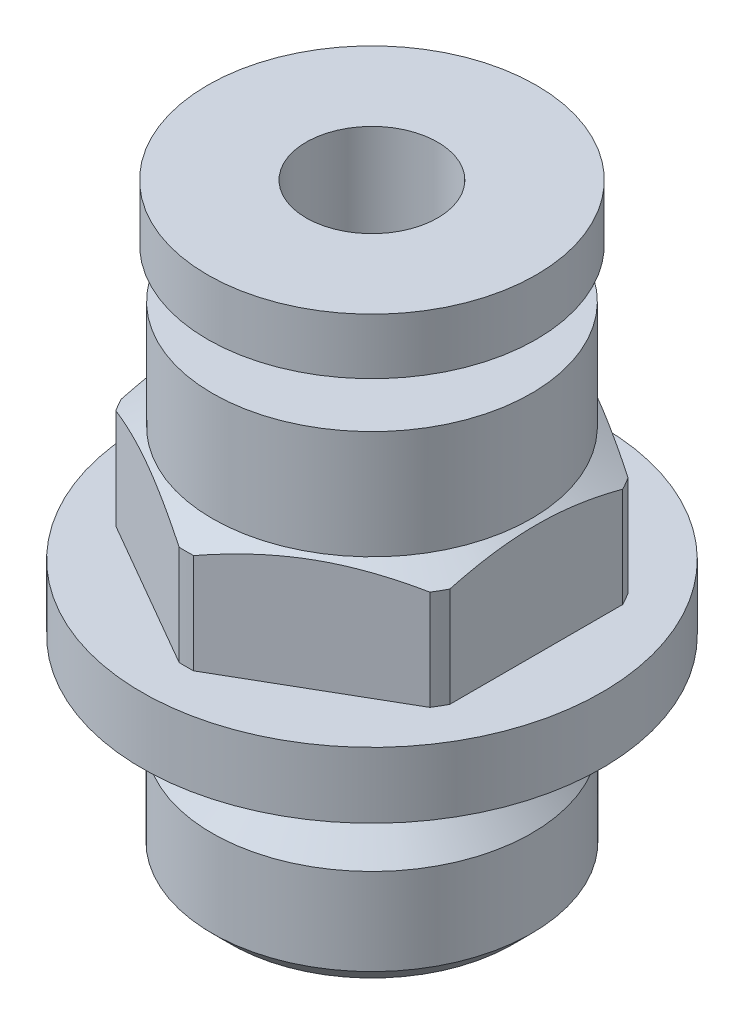
ISO-10303-21;
HEADER;
FILE_DESCRIPTION(('STEP AP214'),'2;1');
FILE_NAME('part.step','',(''),(''),'','','');
FILE_SCHEMA(('AUTOMOTIVE_DESIGN { 1 0 10303 214 1 1 1 1 }'));
ENDSEC;
DATA;
#1=APPLICATION_CONTEXT('core data for automotive mechanical design processes');
#2=APPLICATION_PROTOCOL_DEFINITION('international standard','automotive_design',2000,#1);
#3=PRODUCT_CONTEXT('',#1,'mechanical');
#4=PRODUCT('Part','Part','',(#3));
#5=PRODUCT_RELATED_PRODUCT_CATEGORY('part','',(#4));
#6=PRODUCT_DEFINITION_FORMATION('','',#4);
#7=PRODUCT_DEFINITION_CONTEXT('part definition',#1,'design');
#8=PRODUCT_DEFINITION('design','',#6,#7);
#9=PRODUCT_DEFINITION_SHAPE('','',#8);
#10=(LENGTH_UNIT() NAMED_UNIT(*) SI_UNIT(.MILLI.,.METRE.));
#11=(NAMED_UNIT(*) PLANE_ANGLE_UNIT() SI_UNIT($,.RADIAN.));
#12=(NAMED_UNIT(*) SI_UNIT($,.STERADIAN.) SOLID_ANGLE_UNIT());
#13=UNCERTAINTY_MEASURE_WITH_UNIT(LENGTH_MEASURE(1.E-05),#10,'distance_accuracy_value','');
#14=(GEOMETRIC_REPRESENTATION_CONTEXT(3) GLOBAL_UNCERTAINTY_ASSIGNED_CONTEXT((#13)) GLOBAL_UNIT_ASSIGNED_CONTEXT((#10,
#11,#12)) REPRESENTATION_CONTEXT('',''));
#15=CARTESIAN_POINT('',(0.,0.,0.));
#16=DIRECTION('',(0.,0.,1.));
#17=DIRECTION('',(1.,0.,0.));
#18=AXIS2_PLACEMENT_3D('',#15,#16,#17);
#19=CARTESIAN_POINT('',(0.,14.8,0.));
#20=DIRECTION('',(0.,1.,0.));
#21=DIRECTION('',(0.,0.,1.));
#22=AXIS2_PLACEMENT_3D('',#19,#20,#21);
#23=PLANE('',#22);
#24=CARTESIAN_POINT('',(0.,14.8,0.));
#25=DIRECTION('',(0.,1.,0.));
#26=DIRECTION('',(0.,0.,1.));
#27=AXIS2_PLACEMENT_3D('',#24,#25,#26);
#28=CIRCLE('',#27,4.85);
#29=CARTESIAN_POINT('',(0.,14.8,4.85));
#30=VERTEX_POINT('',#29);
#31=EDGE_CURVE('E425',#30,#30,#28,.T.);
#32=ORIENTED_EDGE('',*,*,#31,.T.);
#33=EDGE_LOOP('',(#32));
#34=FACE_BOUND('',#33,.T.);
#35=CARTESIAN_POINT('',(0.,14.8,0.));
#36=DIRECTION('',(0.,1.,0.));
#37=DIRECTION('',(0.,0.,1.));
#38=AXIS2_PLACEMENT_3D('',#35,#36,#37);
#39=CIRCLE('',#38,2.55);
#40=CARTESIAN_POINT('',(0.,14.8,2.55));
#41=VERTEX_POINT('',#40);
#42=EDGE_CURVE('E741',#41,#41,#39,.T.);
#43=ORIENTED_EDGE('',*,*,#42,.F.);
#44=EDGE_LOOP('',(#43));
#45=FACE_BOUND('',#44,.T.);
#46=ADVANCED_FACE('F63',(#34,#45),#23,.T.);
#47=CARTESIAN_POINT('',(0.,3.983,0.));
#48=DIRECTION('',(0.,-1.,0.));
#49=DIRECTION('',(0.,0.,-1.));
#50=AXIS2_PLACEMENT_3D('',#47,#48,#49);
#51=CONICAL_SURFACE('',#50,4.1,0.785398163397448);
#52=CARTESIAN_POINT('',(0.,3.219,0.));
#53=DIRECTION('',(0.,-1.,0.));
#54=DIRECTION('',(0.,0.,-1.));
#55=AXIS2_PLACEMENT_3D('',#52,#53,#54);
#56=CIRCLE('',#55,4.864);
#57=CARTESIAN_POINT('',(0.,3.219,-4.864));
#58=VERTEX_POINT('',#57);
#59=EDGE_CURVE('E381',#58,#58,#56,.T.);
#60=ORIENTED_EDGE('',*,*,#59,.F.);
#61=EDGE_LOOP('',(#60));
#62=FACE_BOUND('',#61,.T.);
#63=CARTESIAN_POINT('',(0.,3.983,0.));
#64=DIRECTION('',(0.,-1.,0.));
#65=DIRECTION('',(0.,0.,-1.));
#66=AXIS2_PLACEMENT_3D('',#63,#64,#65);
#67=CIRCLE('',#66,4.1);
#68=CARTESIAN_POINT('',(0.,3.983,-4.1));
#69=VERTEX_POINT('',#68);
#70=EDGE_CURVE('E373',#69,#69,#67,.F.);
#71=ORIENTED_EDGE('',*,*,#70,.F.);
#72=EDGE_LOOP('',(#71));
#73=FACE_BOUND('',#72,.T.);
#74=ADVANCED_FACE('F691',(#62,#73),#51,.T.);
#75=CARTESIAN_POINT('',(0.,3.983,0.));
#76=DIRECTION('',(0.,-1.,0.));
#77=DIRECTION('',(0.,0.,-1.));
#78=AXIS2_PLACEMENT_3D('',#75,#76,#77);
#79=CYLINDRICAL_SURFACE('',#78,4.1);
#80=ORIENTED_EDGE('',*,*,#70,.T.);
#81=EDGE_LOOP('',(#80));
#82=FACE_BOUND('',#81,.T.);
#83=CARTESIAN_POINT('',(0.,6.,0.));
#84=DIRECTION('',(0.,-1.,0.));
#85=DIRECTION('',(0.,0.,-1.));
#86=AXIS2_PLACEMENT_3D('',#83,#84,#85);
#87=CIRCLE('',#86,4.1);
#88=CARTESIAN_POINT('',(0.,6.,-4.1));
#89=VERTEX_POINT('',#88);
#90=EDGE_CURVE('E362',#89,#89,#87,.F.);
#91=ORIENTED_EDGE('',*,*,#90,.F.);
#92=EDGE_LOOP('',(#91));
#93=FACE_BOUND('',#92,.T.);
#94=ADVANCED_FACE('F697',(#82,#93),#79,.T.);
#95=CARTESIAN_POINT('',(0.,6.,0.));
#96=DIRECTION('',(0.,-1.,0.));
#97=DIRECTION('',(0.,0.,-1.));
#98=AXIS2_PLACEMENT_3D('',#95,#96,#97);
#99=TOROIDAL_SURFACE('',#98,4.99,0.89);
#100=ORIENTED_EDGE('',*,*,#90,.T.);
#101=EDGE_LOOP('',(#100));
#102=FACE_BOUND('',#101,.T.);
#103=CARTESIAN_POINT('',(0.,6.,0.));
#104=DIRECTION('',(0.,-1.,0.));
#105=DIRECTION('',(0.,0.,-1.));
#106=AXIS2_PLACEMENT_3D('',#103,#104,#105);
#107=CIRCLE('',#106,5.88);
#108=CARTESIAN_POINT('',(0.,6.,-5.88));
#109=VERTEX_POINT('',#108);
#110=EDGE_CURVE('E358',#109,#109,#107,.F.);
#111=ORIENTED_EDGE('',*,*,#110,.F.);
#112=EDGE_LOOP('',(#111));
#113=FACE_BOUND('',#112,.T.);
#114=ADVANCED_FACE('F920',(#102,#113),#99,.T.);
#115=CARTESIAN_POINT('',(-7.08400000000001,6.,7.084));
#116=DIRECTION('',(0.,-1.,0.));
#117=DIRECTION('',(0.,0.,-1.));
#118=AXIS2_PLACEMENT_3D('',#115,#116,#117);
#119=PLANE('',#118);
#120=ORIENTED_EDGE('',*,*,#110,.T.);
#121=EDGE_LOOP('',(#120));
#122=FACE_BOUND('',#121,.T.);
#123=CARTESIAN_POINT('',(0.,6.,0.));
#124=DIRECTION('',(0.,-1.,0.));
#125=DIRECTION('',(0.,0.,-1.));
#126=AXIS2_PLACEMENT_3D('',#123,#124,#125);
#127=CIRCLE('',#126,7.);
#128=CARTESIAN_POINT('',(0.,6.,-7.));
#129=VERTEX_POINT('',#128);
#130=EDGE_CURVE('E233',#129,#129,#127,.F.);
#131=ORIENTED_EDGE('',*,*,#130,.F.);
#132=EDGE_LOOP('',(#131));
#133=FACE_BOUND('',#132,.T.);
#134=ADVANCED_FACE('F911',(#122,#133),#119,.T.);
#135=CARTESIAN_POINT('',(0.,8.,0.));
#136=DIRECTION('',(0.,-1.,0.));
#137=DIRECTION('',(0.,0.,-1.));
#138=AXIS2_PLACEMENT_3D('',#135,#136,#137);
#139=CYLINDRICAL_SURFACE('',#138,5.65);
#140=DIRECTION('',(0.,1.,0.));
#141=VECTOR('',#140,1.);
#142=CARTESIAN_POINT('',(4.7785686296445,8.,3.01459480722991));
#143=LINE('',#142,#141);
#144=CARTESIAN_POINT('',(4.77856862964448,8.,3.01459480722992));
#145=VERTEX_POINT('',#144);
#146=CARTESIAN_POINT('',(4.77856862964449,11.0381197846483,3.01459480722992));
#147=VERTEX_POINT('',#146);
#148=EDGE_CURVE('E440',#145,#147,#143,.T.);
#149=ORIENTED_EDGE('',*,*,#148,.F.);
#150=CARTESIAN_POINT('',(0.,8.,0.));
#151=DIRECTION('',(0.,-1.,0.));
#152=DIRECTION('',(0.,0.,-1.));
#153=AXIS2_PLACEMENT_3D('',#150,#151,#152);
#154=CIRCLE('',#153,5.65);
#155=CARTESIAN_POINT('',(4.99999999999998,8.,2.63106442338458));
#156=VERTEX_POINT('',#155);
#157=EDGE_CURVE('E369',#145,#156,#154,.F.);
#158=ORIENTED_EDGE('',*,*,#157,.T.);
#159=DIRECTION('',(0.,1.,0.));
#160=VECTOR('',#159,1.);
#161=CARTESIAN_POINT('',(5.,8.,2.63106442338457));
#162=LINE('',#161,#160);
#163=CARTESIAN_POINT('',(5.,11.0381197846483,2.63106442338457));
#164=VERTEX_POINT('',#163);
#165=EDGE_CURVE('E615',#164,#156,#162,.F.);
#166=ORIENTED_EDGE('',*,*,#165,.F.);
#167=CARTESIAN_POINT('',(0.,11.0381197846483,0.));
#168=DIRECTION('',(0.,-1.,0.));
#169=DIRECTION('',(0.,0.,-1.));
#170=AXIS2_PLACEMENT_3D('',#167,#168,#169);
#171=CIRCLE('',#170,5.65);
#172=EDGE_CURVE('E361',#164,#147,#171,.T.);
#173=ORIENTED_EDGE('',*,*,#172,.T.);
#174=EDGE_LOOP('',(#149,#158,#166,#173));
#175=FACE_BOUND('',#174,.T.);
#176=ADVANCED_FACE('F902',(#175),#139,.T.);
#177=CARTESIAN_POINT('',(0.,8.,0.));
#178=DIRECTION('',(0.,-1.,0.));
#179=DIRECTION('',(0.,0.,-1.));
#180=AXIS2_PLACEMENT_3D('',#177,#178,#179);
#181=CYLINDRICAL_SURFACE('',#180,5.65);
#182=DIRECTION('',(0.,1.,0.));
#183=VECTOR('',#182,1.);
#184=CARTESIAN_POINT('',(-0.2214313703555,8.,5.64565923061448));
#185=LINE('',#184,#183);
#186=CARTESIAN_POINT('',(-0.221431370355493,8.,5.6456592306145));
#187=VERTEX_POINT('',#186);
#188=CARTESIAN_POINT('',(-0.2214313703555,11.0381197846483,5.64565923061448));
#189=VERTEX_POINT('',#188);
#190=EDGE_CURVE('E591',#187,#189,#185,.T.);
#191=ORIENTED_EDGE('',*,*,#190,.F.);
#192=CARTESIAN_POINT('',(0.,8.,0.));
#193=DIRECTION('',(0.,-1.,0.));
#194=DIRECTION('',(0.,0.,-1.));
#195=AXIS2_PLACEMENT_3D('',#192,#193,#194);
#196=CIRCLE('',#195,5.65);
#197=CARTESIAN_POINT('',(0.221431370355489,8.,5.6456592306145));
#198=VERTEX_POINT('',#197);
#199=EDGE_CURVE('E196',#187,#198,#196,.F.);
#200=ORIENTED_EDGE('',*,*,#199,.T.);
#201=DIRECTION('',(0.,1.,0.));
#202=VECTOR('',#201,1.);
#203=CARTESIAN_POINT('',(0.2214313703555,8.,5.64565923061448));
#204=LINE('',#203,#202);
#205=CARTESIAN_POINT('',(0.2214313703555,11.0381197846483,5.64565923061448));
#206=VERTEX_POINT('',#205);
#207=EDGE_CURVE('E492',#206,#198,#204,.F.);
#208=ORIENTED_EDGE('',*,*,#207,.F.);
#209=CARTESIAN_POINT('',(0.,11.0381197846483,0.));
#210=DIRECTION('',(0.,-1.,0.));
#211=DIRECTION('',(0.,0.,-1.));
#212=AXIS2_PLACEMENT_3D('',#209,#210,#211);
#213=CIRCLE('',#212,5.65);
#214=EDGE_CURVE('E550',#206,#189,#213,.T.);
#215=ORIENTED_EDGE('',*,*,#214,.T.);
#216=EDGE_LOOP('',(#191,#200,#208,#215));
#217=FACE_BOUND('',#216,.T.);
#218=ADVANCED_FACE('F894',(#217),#181,.T.);
#219=CARTESIAN_POINT('',(0.,8.,0.));
#220=DIRECTION('',(0.,-1.,0.));
#221=DIRECTION('',(0.,0.,-1.));
#222=AXIS2_PLACEMENT_3D('',#219,#220,#221);
#223=CYLINDRICAL_SURFACE('',#222,5.65);
#224=DIRECTION('',(0.,1.,0.));
#225=VECTOR('',#224,1.);
#226=CARTESIAN_POINT('',(-5.,8.,2.63106442338458));
#227=LINE('',#226,#225);
#228=CARTESIAN_POINT('',(-4.99999999999998,8.,2.63106442338459));
#229=VERTEX_POINT('',#228);
#230=CARTESIAN_POINT('',(-5.,11.0381197846483,2.63106442338458));
#231=VERTEX_POINT('',#230);
#232=EDGE_CURVE('E186',#229,#231,#227,.T.);
#233=ORIENTED_EDGE('',*,*,#232,.F.);
#234=CARTESIAN_POINT('',(0.,8.,0.));
#235=DIRECTION('',(0.,-1.,0.));
#236=DIRECTION('',(0.,0.,-1.));
#237=AXIS2_PLACEMENT_3D('',#234,#235,#236);
#238=CIRCLE('',#237,5.65);
#239=CARTESIAN_POINT('',(-4.77856862964448,8.,3.01459480722992));
#240=VERTEX_POINT('',#239);
#241=EDGE_CURVE('E195',#229,#240,#238,.F.);
#242=ORIENTED_EDGE('',*,*,#241,.T.);
#243=DIRECTION('',(0.,1.,0.));
#244=VECTOR('',#243,1.);
#245=CARTESIAN_POINT('',(-4.7785686296445,8.,3.01459480722991));
#246=LINE('',#245,#244);
#247=CARTESIAN_POINT('',(-4.7785686296445,11.0381197846483,3.01459480722991));
#248=VERTEX_POINT('',#247);
#249=EDGE_CURVE('E189',#248,#240,#246,.F.);
#250=ORIENTED_EDGE('',*,*,#249,.F.);
#251=CARTESIAN_POINT('',(0.,11.0381197846483,0.));
#252=DIRECTION('',(0.,-1.,0.));
#253=DIRECTION('',(0.,0.,-1.));
#254=AXIS2_PLACEMENT_3D('',#251,#252,#253);
#255=CIRCLE('',#254,5.65);
#256=EDGE_CURVE('E183',#248,#231,#255,.T.);
#257=ORIENTED_EDGE('',*,*,#256,.T.);
#258=EDGE_LOOP('',(#233,#242,#250,#257));
#259=FACE_BOUND('',#258,.T.);
#260=ADVANCED_FACE('F185',(#259),#223,.T.);
#261=CARTESIAN_POINT('',(0.,8.,0.));
#262=DIRECTION('',(0.,-1.,0.));
#263=DIRECTION('',(0.,0.,-1.));
#264=AXIS2_PLACEMENT_3D('',#261,#262,#263);
#265=CYLINDRICAL_SURFACE('',#264,5.65);
#266=DIRECTION('',(0.,1.,0.));
#267=VECTOR('',#266,1.);
#268=CARTESIAN_POINT('',(5.,8.,-2.63106442338468));
#269=LINE('',#268,#267);
#270=CARTESIAN_POINT('',(4.99999999999999,8.,-2.63106442338462));
#271=VERTEX_POINT('',#270);
#272=CARTESIAN_POINT('',(5.,11.0381197846483,-2.63106442338463));
#273=VERTEX_POINT('',#272);
#274=EDGE_CURVE('E490',#271,#273,#269,.T.);
#275=ORIENTED_EDGE('',*,*,#274,.F.);
#276=CARTESIAN_POINT('',(0.,8.,0.));
#277=DIRECTION('',(0.,-1.,0.));
#278=DIRECTION('',(0.,0.,-1.));
#279=AXIS2_PLACEMENT_3D('',#276,#277,#278);
#280=CIRCLE('',#279,5.65);
#281=CARTESIAN_POINT('',(4.77856862964449,8.,-3.01459480722991));
#282=VERTEX_POINT('',#281);
#283=EDGE_CURVE('E477',#271,#282,#280,.F.);
#284=ORIENTED_EDGE('',*,*,#283,.T.);
#285=DIRECTION('',(0.,1.,0.));
#286=VECTOR('',#285,1.);
#287=CARTESIAN_POINT('',(4.7785686296445,8.,-3.01459480722991));
#288=LINE('',#287,#286);
#289=CARTESIAN_POINT('',(4.7785686296445,11.0381197846483,-3.01459480722991));
#290=VERTEX_POINT('',#289);
#291=EDGE_CURVE('E205',#290,#282,#288,.F.);
#292=ORIENTED_EDGE('',*,*,#291,.F.);
#293=CARTESIAN_POINT('',(0.,11.0381197846483,0.));
#294=DIRECTION('',(0.,-1.,0.));
#295=DIRECTION('',(0.,0.,-1.));
#296=AXIS2_PLACEMENT_3D('',#293,#294,#295);
#297=CIRCLE('',#296,5.65);
#298=EDGE_CURVE('E472',#290,#273,#297,.T.);
#299=ORIENTED_EDGE('',*,*,#298,.T.);
#300=EDGE_LOOP('',(#275,#284,#292,#299));
#301=FACE_BOUND('',#300,.T.);
#302=ADVANCED_FACE('F680',(#301),#265,.T.);
#303=CARTESIAN_POINT('',(0.,6.,0.));
#304=DIRECTION('',(0.,-1.,0.));
#305=DIRECTION('',(0.,0.,-1.));
#306=AXIS2_PLACEMENT_3D('',#303,#304,#305);
#307=CYLINDRICAL_SURFACE('',#306,7.);
#308=ORIENTED_EDGE('',*,*,#130,.T.);
#309=EDGE_LOOP('',(#308));
#310=FACE_BOUND('',#309,.T.);
#311=CARTESIAN_POINT('',(0.,8.,0.));
#312=DIRECTION('',(0.,-1.,0.));
#313=DIRECTION('',(0.,0.,-1.));
#314=AXIS2_PLACEMENT_3D('',#311,#312,#313);
#315=CIRCLE('',#314,7.);
#316=CARTESIAN_POINT('',(0.,8.,-7.));
#317=VERTEX_POINT('',#316);
#318=EDGE_CURVE('E299',#317,#317,#315,.F.);
#319=ORIENTED_EDGE('',*,*,#318,.F.);
#320=EDGE_LOOP('',(#319));
#321=FACE_BOUND('',#320,.T.);
#322=ADVANCED_FACE('F678',(#310,#321),#307,.T.);
#323=CARTESIAN_POINT('',(5.,8.,2.63106442338457));
#324=DIRECTION('',(1.,0.,0.));
#325=DIRECTION('',(0.,0.,-1.));
#326=AXIS2_PLACEMENT_3D('',#323,#324,#325);
#327=PLANE('',#326);
#328=ORIENTED_EDGE('',*,*,#165,.T.);
#329=DIRECTION('',(0.,0.,1.));
#330=VECTOR('',#329,1.);
#331=CARTESIAN_POINT('',(4.99999999999995,8.,0.));
#332=LINE('',#331,#330);
#333=EDGE_CURVE('E565',#271,#156,#332,.T.);
#334=ORIENTED_EDGE('',*,*,#333,.F.);
#335=ORIENTED_EDGE('',*,*,#274,.T.);
#336=CARTESIAN_POINT('',(5.,11.0381197846483,2.63106442338459));
#337=CARTESIAN_POINT('',(5.,11.0716791860062,2.50623051639842));
#338=CARTESIAN_POINT('',(5.,11.1034995369539,2.38092848319098));
#339=CARTESIAN_POINT('',(5.,11.1632197411101,2.1293534946512));
#340=CARTESIAN_POINT('',(5.,11.1911183339445,2.00308024087693));
#341=CARTESIAN_POINT('',(5.,11.2683176792158,1.62247253746527));
#342=CARTESIAN_POINT('',(5.,11.3110132599278,1.366743952635));
#343=CARTESIAN_POINT('',(5.,11.3745835287302,0.858362458645548));
#344=CARTESIAN_POINT('',(5.,11.3959288809974,0.605770365116666));
#345=CARTESIAN_POINT('',(5.,11.4113633479822,0.226377542800942));
#346=CARTESIAN_POINT('',(5.,11.4137464704296,0.09987703038702));
#347=CARTESIAN_POINT('',(5.,11.4129666646811,-0.153103973622258));
#348=CARTESIAN_POINT('',(5.,11.4098040049261,-0.279584465890311));
#349=CARTESIAN_POINT('',(5.,11.3951850252362,-0.592406635178596));
#350=CARTESIAN_POINT('',(5.,11.3804991500097,-0.778603620671558));
#351=CARTESIAN_POINT('',(5.,11.3399204387064,-1.1498404996673));
#352=CARTESIAN_POINT('',(5.,11.3140220333512,-1.3348797717377));
#353=CARTESIAN_POINT('',(5.,11.251669364345,-1.70640713055064));
#354=CARTESIAN_POINT('',(5.,11.2150416208698,-1.89286560773726));
#355=CARTESIAN_POINT('',(5.,11.1328916246093,-2.26359687926452));
#356=CARTESIAN_POINT('',(5.,11.0873797434209,-2.44787195901238));
#357=CARTESIAN_POINT('',(5.,11.0381197846483,-2.63106442338462));
#358=B_SPLINE_CURVE_WITH_KNOTS('',3,(#336,#337,#338,#339,#340,#341,#342,#343,#344,#345,#346,
#347,#348,#349,#350,#351,#352,#353,#354,#355,#356,#357),.UNSPECIFIED.,.F.,.F.,(4,2,2,2,2,2,2,2,
2,2,4),(0.,0.387779560085222,0.775683461183912,1.55271447725653,2.31221118548422,
2.69167299650802,3.07111644037376,3.63105689212536,4.19127578668472,4.76110615321377,
5.33027521953319),.UNSPECIFIED.);
#359=EDGE_CURVE('E272',#164,#273,#358,.T.);
#360=ORIENTED_EDGE('',*,*,#359,.F.);
#361=EDGE_LOOP('',(#328,#334,#335,#360));
#362=FACE_BOUND('',#361,.T.);
#363=ADVANCED_FACE('F261',(#362),#327,.T.);
#364=CARTESIAN_POINT('',(0.2214313703555,8.,5.64565923061448));
#365=DIRECTION('',(0.499999999999999,0.,0.866025403784439));
#366=DIRECTION('',(0.866025403784439,0.,-0.499999999999999));
#367=AXIS2_PLACEMENT_3D('',#364,#365,#366);
#368=PLANE('',#367);
#369=ORIENTED_EDGE('',*,*,#207,.T.);
#370=CARTESIAN_POINT('',(4.77856862964446,8.,3.01459480722992));
#371=CARTESIAN_POINT('',(4.58868791050742,8.,3.12422249153761));
#372=CARTESIAN_POINT('',(4.39880719137038,8.,3.23385017584531));
#373=CARTESIAN_POINT('',(4.0190457530963,8.,3.45310554446069));
#374=CARTESIAN_POINT('',(3.82916503395926,8.,3.56273322876838));
#375=CARTESIAN_POINT('',(3.44940359568518,8.,3.78198859738376));
#376=CARTESIAN_POINT('',(3.25952287654814,8.,3.89161628169146));
#377=CARTESIAN_POINT('',(2.87976143827405,8.,4.11087165030684));
#378=CARTESIAN_POINT('',(2.68988071913701,8.,4.22049933461453));
#379=CARTESIAN_POINT('',(2.31011928086293,8.,4.43975470322992));
#380=CARTESIAN_POINT('',(2.12023856172589,8.,4.54938238753761));
#381=CARTESIAN_POINT('',(1.74047712345181,8.,4.76863775615299));
#382=CARTESIAN_POINT('',(1.55059640431477,8.,4.87826544046069));
#383=CARTESIAN_POINT('',(1.17083496604069,8.,5.09752080907607));
#384=CARTESIAN_POINT('',(0.980954246903649,8.,5.20714849338376));
#385=CARTESIAN_POINT('',(0.601192808629568,8.,5.42640386199915));
#386=CARTESIAN_POINT('',(0.411312089492528,8.,5.53603154630684));
#387=CARTESIAN_POINT('',(0.221431370355488,8.,5.64565923061453));
#388=B_SPLINE_CURVE_WITH_KNOTS('',3,(#370,#371,#372,#373,#374,#375,#376,#377,#378,#379,#380,
#381,#382,#383,#384,#385,#386,#387),.UNSPECIFIED.,.F.,.F.,(4,2,2,2,2,2,2,2,4),(0.,
0.657766105846144,1.31553221169228,1.97329831753843,2.63106442338457,3.28883052923072,
3.94659663507686,4.604362740923,5.26212884676915),.UNSPECIFIED.);
#389=EDGE_CURVE('E1189',#145,#198,#388,.T.);
#390=ORIENTED_EDGE('',*,*,#389,.F.);
#391=ORIENTED_EDGE('',*,*,#148,.T.);
#392=CARTESIAN_POINT('',(0.221431370355484,11.0381197846483,5.64565923061449));
#393=CARTESIAN_POINT('',(0.329540705059166,11.0716791860062,5.58324227712141));
#394=CARTESIAN_POINT('',(0.438055448962651,11.1034995369539,5.52059126051769));
#395=CARTESIAN_POINT('',(0.655925779994884,11.1632197411101,5.39480376624779));
#396=CARTESIAN_POINT('',(0.765281625581917,11.1911183339445,5.33166713936066));
#397=CARTESIAN_POINT('',(1.09489756561247,11.2683176792158,5.14136328765483));
#398=CARTESIAN_POINT('',(1.31636501654933,11.3110132599278,5.01349899523969));
#399=CARTESIAN_POINT('',(1.75663630515808,11.3745835287302,4.75930824824497));
#400=CARTESIAN_POINT('',(1.97538747494919,11.3959288809974,4.63301220148053));
#401=CARTESIAN_POINT('',(2.30395129708808,11.4113633479822,4.44331579032267));
#402=CARTESIAN_POINT('',(2.41350395443029,11.4137464704296,4.38006553411571));
#403=CARTESIAN_POINT('',(2.63259193057721,11.4129666646811,4.25357503211107));
#404=CARTESIAN_POINT('',(2.74212724996451,11.4098040049261,4.19033478597704));
#405=CARTESIAN_POINT('',(3.01303919543512,11.3951850252362,4.0339237013329));
#406=CARTESIAN_POINT('',(3.1742905149801,11.3804991500097,3.94082520858642));
#407=CARTESIAN_POINT('',(3.49579108301206,11.3399204387064,3.75520676908856));
#408=CARTESIAN_POINT('',(3.65603979332281,11.3140220333512,3.66268713305336));
#409=CARTESIAN_POINT('',(3.97779192425575,11.251669364345,3.47692345364689));
#410=CARTESIAN_POINT('',(4.13926970225031,11.2150416208699,3.38369421505358));
#411=CARTESIAN_POINT('',(4.46033240137023,11.1328916246093,3.19832857928995));
#412=CARTESIAN_POINT('',(4.61991930171627,11.0873797434209,3.10619103941603));
#413=CARTESIAN_POINT('',(4.77856862964451,11.0381197846483,3.01459480722991));
#414=B_SPLINE_CURVE_WITH_KNOTS('',3,(#392,#393,#394,#395,#396,#397,#398,#399,#400,#401,#402,
#403,#404,#405,#406,#407,#408,#409,#410,#411,#412,#413),.UNSPECIFIED.,.F.,.F.,(4,2,2,2,2,2,2,2,
2,2,4),(0.,0.387779560085221,0.775683461183911,1.55271447725653,2.31221118548422,
2.69167299650802,3.07111644037376,3.63105689212535,4.1912757866847,4.76110615321374,
5.33027521953315),.UNSPECIFIED.);
#415=EDGE_CURVE('E217',#206,#147,#414,.T.);
#416=ORIENTED_EDGE('',*,*,#415,.F.);
#417=EDGE_LOOP('',(#369,#390,#391,#416));
#418=FACE_BOUND('',#417,.T.);
#419=ADVANCED_FACE('F255',(#418),#368,.T.);
#420=CARTESIAN_POINT('',(-4.7785686296445,8.,3.01459480722991));
#421=DIRECTION('',(-0.499999999999999,0.,0.866025403784439));
#422=DIRECTION('',(0.866025403784439,0.,0.499999999999999));
#423=AXIS2_PLACEMENT_3D('',#420,#421,#422);
#424=PLANE('',#423);
#425=ORIENTED_EDGE('',*,*,#249,.T.);
#426=CARTESIAN_POINT('',(-0.221431370355486,8.,5.64565923061453));
#427=CARTESIAN_POINT('',(-0.411312089492527,8.,5.53603154630684));
#428=CARTESIAN_POINT('',(-0.601192808629567,8.,5.42640386199915));
#429=CARTESIAN_POINT('',(-0.980954246903648,8.,5.20714849338376));
#430=CARTESIAN_POINT('',(-1.17083496604069,8.,5.09752080907607));
#431=CARTESIAN_POINT('',(-1.55059640431477,8.,4.87826544046069));
#432=CARTESIAN_POINT('',(-1.74047712345181,8.,4.76863775615299));
#433=CARTESIAN_POINT('',(-2.12023856172589,8.,4.54938238753761));
#434=CARTESIAN_POINT('',(-2.31011928086293,8.,4.43975470322992));
#435=CARTESIAN_POINT('',(-2.68988071913701,8.,4.22049933461453));
#436=CARTESIAN_POINT('',(-2.87976143827405,8.,4.11087165030684));
#437=CARTESIAN_POINT('',(-3.25952287654813,8.,3.89161628169146));
#438=CARTESIAN_POINT('',(-3.44940359568518,8.,3.78198859738376));
#439=CARTESIAN_POINT('',(-3.82916503395926,8.,3.56273322876838));
#440=CARTESIAN_POINT('',(-4.0190457530963,8.,3.45310554446069));
#441=CARTESIAN_POINT('',(-4.39880719137038,8.,3.23385017584531));
#442=CARTESIAN_POINT('',(-4.58868791050742,8.,3.12422249153761));
#443=CARTESIAN_POINT('',(-4.77856862964446,8.,3.01459480722992));
#444=B_SPLINE_CURVE_WITH_KNOTS('',3,(#426,#427,#428,#429,#430,#431,#432,#433,#434,#435,#436,
#437,#438,#439,#440,#441,#442,#443),.UNSPECIFIED.,.F.,.F.,(4,2,2,2,2,2,2,2,4),(0.,
0.657766105846144,1.31553221169229,1.97329831753843,2.63106442338457,3.28883052923072,
3.94659663507686,4.604362740923,5.26212884676915),.UNSPECIFIED.);
#445=EDGE_CURVE('E548',#187,#240,#444,.T.);
#446=ORIENTED_EDGE('',*,*,#445,.F.);
#447=ORIENTED_EDGE('',*,*,#190,.T.);
#448=CARTESIAN_POINT('',(-4.77856862964451,11.0381197846483,3.0145948072299));
#449=CARTESIAN_POINT('',(-4.67045929494083,11.0716791860062,3.07701176072299));
#450=CARTESIAN_POINT('',(-4.56194455103735,11.1034995369539,3.13966277732671));
#451=CARTESIAN_POINT('',(-4.34407422000511,11.1632197411101,3.2654502715966));
#452=CARTESIAN_POINT('',(-4.23471837441808,11.1911183339445,3.32858689848373));
#453=CARTESIAN_POINT('',(-3.90510243438753,11.2683176792158,3.51889075018956));
#454=CARTESIAN_POINT('',(-3.68363498345066,11.3110132599278,3.6467550426047));
#455=CARTESIAN_POINT('',(-3.24336369484191,11.3745835287302,3.90094578959942));
#456=CARTESIAN_POINT('',(-3.02461252505081,11.3959288809974,4.02724183636386));
#457=CARTESIAN_POINT('',(-2.69604870291191,11.4113633479822,4.21693824752173));
#458=CARTESIAN_POINT('',(-2.58649604556971,11.4137464704296,4.28018850372869));
#459=CARTESIAN_POINT('',(-2.36740806942278,11.4129666646811,4.40667900573333));
#460=CARTESIAN_POINT('',(-2.25787275003548,11.4098040049261,4.46991925186735));
#461=CARTESIAN_POINT('',(-1.98696080456487,11.3951850252362,4.62633033651149));
#462=CARTESIAN_POINT('',(-1.82570948501989,11.3804991500097,4.71942882925797));
#463=CARTESIAN_POINT('',(-1.50420891698793,11.3399204387064,4.90504726875584));
#464=CARTESIAN_POINT('',(-1.34396020667719,11.3140220333512,4.99756690479104));
#465=CARTESIAN_POINT('',(-1.02220807574424,11.251669364345,5.18333058419751));
#466=CARTESIAN_POINT('',(-0.860730297749674,11.2150416208699,5.27655982279082));
#467=CARTESIAN_POINT('',(-0.539667598629761,11.1328916246093,5.46192545855445));
#468=CARTESIAN_POINT('',(-0.380080698283719,11.0873797434209,5.55406299842837));
#469=CARTESIAN_POINT('',(-0.22143137035548,11.0381197846483,5.64565923061449));
#470=B_SPLINE_CURVE_WITH_KNOTS('',3,(#448,#449,#450,#451,#452,#453,#454,#455,#456,#457,#458,
#459,#460,#461,#462,#463,#464,#465,#466,#467,#468,#469),.UNSPECIFIED.,.F.,.F.,(4,2,2,2,2,2,2,2,
2,2,4),(0.,0.387779560085222,0.775683461183912,1.55271447725653,2.31221118548422,
2.69167299650802,3.07111644037376,3.63105689212535,4.19127578668471,4.76110615321375,
5.33027521953317),.UNSPECIFIED.);
#471=EDGE_CURVE('E212',#248,#189,#470,.T.);
#472=ORIENTED_EDGE('',*,*,#471,.F.);
#473=EDGE_LOOP('',(#425,#446,#447,#472));
#474=FACE_BOUND('',#473,.T.);
#475=ADVANCED_FACE('F249',(#474),#424,.T.);
#476=CARTESIAN_POINT('',(-5.,8.,-2.63106442338468));
#477=DIRECTION('',(-1.,0.,0.));
#478=DIRECTION('',(0.,0.,1.));
#479=AXIS2_PLACEMENT_3D('',#476,#477,#478);
#480=PLANE('',#479);
#481=DIRECTION('',(0.,1.,0.));
#482=VECTOR('',#481,1.);
#483=CARTESIAN_POINT('',(-5.,9.51905989232419,-2.63106442338457));
#484=LINE('',#483,#482);
#485=CARTESIAN_POINT('',(-4.99999999999997,8.,-2.63106442338459));
#486=VERTEX_POINT('',#485);
#487=CARTESIAN_POINT('',(-5.,11.0381197846483,-2.6310644233846));
#488=VERTEX_POINT('',#487);
#489=EDGE_CURVE('E176',#486,#488,#484,.T.);
#490=ORIENTED_EDGE('',*,*,#489,.F.);
#491=DIRECTION('',(0.,0.,-1.));
#492=VECTOR('',#491,1.);
#493=CARTESIAN_POINT('',(-4.99999999999995,8.,0.));
#494=LINE('',#493,#492);
#495=EDGE_CURVE('E203',#229,#486,#494,.T.);
#496=ORIENTED_EDGE('',*,*,#495,.F.);
#497=ORIENTED_EDGE('',*,*,#232,.T.);
#498=CARTESIAN_POINT('',(-5.,11.0381197846483,-2.63106442338464));
#499=CARTESIAN_POINT('',(-5.,11.0716791860062,-2.50623051639847));
#500=CARTESIAN_POINT('',(-5.,11.1034995369538,-2.38092848319103));
#501=CARTESIAN_POINT('',(-5.,11.1632197411101,-2.12935349465125));
#502=CARTESIAN_POINT('',(-5.,11.1911183339445,-2.00308024087698));
#503=CARTESIAN_POINT('',(-5.,11.2683176792158,-1.62247253746532));
#504=CARTESIAN_POINT('',(-5.,11.3110132599278,-1.36674395263504));
#505=CARTESIAN_POINT('',(-5.,11.3745835287302,-0.858362458645592));
#506=CARTESIAN_POINT('',(-5.,11.3959288809974,-0.605770365116709));
#507=CARTESIAN_POINT('',(-5.,11.4113633479822,-0.226377542800984));
#508=CARTESIAN_POINT('',(-5.,11.4137464704296,-0.0998770303870607));
#509=CARTESIAN_POINT('',(-5.,11.4129666646811,0.153103973622218));
#510=CARTESIAN_POINT('',(-5.,11.4098040049261,0.279584465890271));
#511=CARTESIAN_POINT('',(-5.,11.3951850252362,0.592406635178558));
#512=CARTESIAN_POINT('',(-5.,11.3804991500097,0.77860362067152));
#513=CARTESIAN_POINT('',(-5.,11.3399204387064,1.14984049966726));
#514=CARTESIAN_POINT('',(-5.,11.3140220333512,1.33487977173767));
#515=CARTESIAN_POINT('',(-5.,11.251669364345,1.70640713055061));
#516=CARTESIAN_POINT('',(-5.,11.2150416208699,1.89286560773723));
#517=CARTESIAN_POINT('',(-5.,11.1328916246093,2.26359687926449));
#518=CARTESIAN_POINT('',(-5.,11.087379743421,2.44787195901235));
#519=CARTESIAN_POINT('',(-5.,11.0381197846483,2.63106442338459));
#520=B_SPLINE_CURVE_WITH_KNOTS('',3,(#498,#499,#500,#501,#502,#503,#504,#505,#506,#507,#508,
#509,#510,#511,#512,#513,#514,#515,#516,#517,#518,#519),.UNSPECIFIED.,.F.,.F.,(4,2,2,2,2,2,2,2,
2,2,4),(0.,0.387779560085223,0.775683461183914,1.55271447725653,2.31221118548423,
2.69167299650803,3.07111644037377,3.63105689212537,4.19127578668474,4.76110615321379,
5.33027521953321),.UNSPECIFIED.);
#521=EDGE_CURVE('E200',#488,#231,#520,.T.);
#522=ORIENTED_EDGE('',*,*,#521,.F.);
#523=EDGE_LOOP('',(#490,#496,#497,#522));
#524=FACE_BOUND('',#523,.T.);
#525=ADVANCED_FACE('F199',(#524),#480,.T.);
#526=CARTESIAN_POINT('',(4.7785686296445,8.,-3.01459480722991));
#527=DIRECTION('',(0.499999999999999,0.,-0.866025403784439));
#528=DIRECTION('',(-0.866025403784439,0.,-0.499999999999999));
#529=AXIS2_PLACEMENT_3D('',#526,#527,#528);
#530=PLANE('',#529);
#531=ORIENTED_EDGE('',*,*,#291,.T.);
#532=CARTESIAN_POINT('',(0.221431370355489,8.,-5.64565923061453));
#533=CARTESIAN_POINT('',(0.411312089492528,8.,-5.53603154630683));
#534=CARTESIAN_POINT('',(0.601192808629568,8.,-5.42640386199914));
#535=CARTESIAN_POINT('',(0.980954246903649,8.,-5.20714849338376));
#536=CARTESIAN_POINT('',(1.17083496604069,8.,-5.09752080907607));
#537=CARTESIAN_POINT('',(1.55059640431477,8.,-4.87826544046069));
#538=CARTESIAN_POINT('',(1.74047712345181,8.,-4.76863775615299));
#539=CARTESIAN_POINT('',(2.12023856172589,8.,-4.54938238753761));
#540=CARTESIAN_POINT('',(2.31011928086293,8.,-4.43975470322992));
#541=CARTESIAN_POINT('',(2.68988071913701,8.,-4.22049933461453));
#542=CARTESIAN_POINT('',(2.87976143827406,8.,-4.11087165030684));
#543=CARTESIAN_POINT('',(3.25952287654814,8.,-3.89161628169146));
#544=CARTESIAN_POINT('',(3.44940359568518,8.,-3.78198859738376));
#545=CARTESIAN_POINT('',(3.82916503395926,8.,-3.56273322876838));
#546=CARTESIAN_POINT('',(4.0190457530963,8.,-3.45310554446069));
#547=CARTESIAN_POINT('',(4.39880719137038,8.,-3.2338501758453));
#548=CARTESIAN_POINT('',(4.58868791050742,8.,-3.12422249153761));
#549=CARTESIAN_POINT('',(4.77856862964446,8.,-3.01459480722992));
#550=B_SPLINE_CURVE_WITH_KNOTS('',3,(#532,#533,#534,#535,#536,#537,#538,#539,#540,#541,#542,
#543,#544,#545,#546,#547,#548,#549),.UNSPECIFIED.,.F.,.F.,(4,2,2,2,2,2,2,2,4),(0.,
0.657766105846142,1.31553221169229,1.97329831753843,2.63106442338457,3.28883052923072,
3.94659663507686,4.604362740923,5.26212884676914),.UNSPECIFIED.);
#551=CARTESIAN_POINT('',(0.221431236204499,8.,-5.64565923587609));
#552=VERTEX_POINT('',#551);
#553=EDGE_CURVE('E572',#552,#282,#550,.T.);
#554=ORIENTED_EDGE('',*,*,#553,.F.);
#555=DIRECTION('',(0.,-1.,0.));
#556=VECTOR('',#555,1.);
#557=CARTESIAN_POINT('',(0.221431370355518,9.51905989232415,-5.64565923061448));
#558=LINE('',#557,#556);
#559=CARTESIAN_POINT('',(0.221431370355504,11.0381197846483,-5.64565923061448));
#560=VERTEX_POINT('',#559);
#561=EDGE_CURVE('E420',#560,#552,#558,.T.);
#562=ORIENTED_EDGE('',*,*,#561,.F.);
#563=CARTESIAN_POINT('',(4.7785686296445,11.0381197846483,-3.01459480722991));
#564=CARTESIAN_POINT('',(4.67045929494082,11.0716791860062,-3.07701176072299));
#565=CARTESIAN_POINT('',(4.56194455103734,11.1034995369539,-3.13966277732671));
#566=CARTESIAN_POINT('',(4.3440742200051,11.1632197411101,-3.2654502715966));
#567=CARTESIAN_POINT('',(4.23471837441807,11.1911183339445,-3.32858689848374));
#568=CARTESIAN_POINT('',(3.90510243438752,11.2683176792158,-3.51889075018957));
#569=CARTESIAN_POINT('',(3.68363498345065,11.3110132599278,-3.6467550426047));
#570=CARTESIAN_POINT('',(3.24336369484191,11.3745835287302,-3.90094578959943));
#571=CARTESIAN_POINT('',(3.0246125250508,11.3959288809974,-4.02724183636387));
#572=CARTESIAN_POINT('',(2.69604870291191,11.4113633479822,-4.21693824752173));
#573=CARTESIAN_POINT('',(2.5864960455697,11.4137464704296,-4.28018850372869));
#574=CARTESIAN_POINT('',(2.36740806942277,11.4129666646811,-4.40667900573333));
#575=CARTESIAN_POINT('',(2.25787275003548,11.4098040049261,-4.46991925186736));
#576=CARTESIAN_POINT('',(1.98696080456487,11.3951850252362,-4.6263303365115));
#577=CARTESIAN_POINT('',(1.82570948501989,11.3804991500097,-4.71942882925797));
#578=CARTESIAN_POINT('',(1.50420891698793,11.3399204387064,-4.90504726875584));
#579=CARTESIAN_POINT('',(1.34396020667719,11.3140220333512,-4.99756690479104));
#580=CARTESIAN_POINT('',(1.02220807574425,11.251669364345,-5.18333058419751));
#581=CARTESIAN_POINT('',(0.86073029774968,11.2150416208699,-5.27655982279081));
#582=CARTESIAN_POINT('',(0.53966759862977,11.1328916246093,-5.46192545855444));
#583=CARTESIAN_POINT('',(0.38008069828373,11.087379743421,-5.55406299842836));
#584=CARTESIAN_POINT('',(0.221431370355491,11.0381197846483,-5.64565923061449));
#585=B_SPLINE_CURVE_WITH_KNOTS('',3,(#563,#564,#565,#566,#567,#568,#569,#570,#571,#572,#573,
#574,#575,#576,#577,#578,#579,#580,#581,#582,#583,#584),.UNSPECIFIED.,.F.,.F.,(4,2,2,2,2,2,2,2,
2,2,4),(0.,0.387779560085221,0.775683461183911,1.55271447725653,2.31221118548422,
2.69167299650802,3.07111644037376,3.63105689212535,4.1912757866847,4.76110615321373,
5.33027521953314),.UNSPECIFIED.);
#586=EDGE_CURVE('E292',#290,#560,#585,.T.);
#587=ORIENTED_EDGE('',*,*,#586,.F.);
#588=EDGE_LOOP('',(#531,#554,#562,#587));
#589=FACE_BOUND('',#588,.T.);
#590=ADVANCED_FACE('F248',(#589),#530,.T.);
#591=CARTESIAN_POINT('',(0.,8.,0.));
#592=DIRECTION('',(0.,-1.,0.));
#593=DIRECTION('',(0.,0.,-1.));
#594=AXIS2_PLACEMENT_3D('',#591,#592,#593);
#595=CYLINDRICAL_SURFACE('',#594,5.65);
#596=ORIENTED_EDGE('',*,*,#489,.T.);
#597=CARTESIAN_POINT('',(0.,11.0381197846483,0.));
#598=DIRECTION('',(0.,1.,0.));
#599=DIRECTION('',(0.,0.,-1.));
#600=AXIS2_PLACEMENT_3D('',#597,#598,#599);
#601=CIRCLE('',#600,5.65000000000005);
#602=CARTESIAN_POINT('',(-4.77856862964454,11.0381197846483,-3.01459480722989));
#603=VERTEX_POINT('',#602);
#604=EDGE_CURVE('E210',#603,#488,#601,.T.);
#605=ORIENTED_EDGE('',*,*,#604,.F.);
#606=DIRECTION('',(0.,1.,0.));
#607=VECTOR('',#606,1.);
#608=CARTESIAN_POINT('',(-4.7785686296445,8.,-3.01459480722991));
#609=LINE('',#608,#607);
#610=CARTESIAN_POINT('',(-4.77856862964449,8.,-3.01459480722991));
#611=VERTEX_POINT('',#610);
#612=EDGE_CURVE('E321',#611,#603,#609,.T.);
#613=ORIENTED_EDGE('',*,*,#612,.F.);
#614=CARTESIAN_POINT('',(-4.99999999999995,8.,-2.63106442338461));
#615=CARTESIAN_POINT('',(-4.99140199487317,8.,-2.64740385448729));
#616=CARTESIAN_POINT('',(-4.98272399740066,8.,-2.66370119431739));
#617=CARTESIAN_POINT('',(-4.96521126243737,8.,-2.6962053815611));
#618=CARTESIAN_POINT('',(-4.95637657082993,8.,-2.71241225369601));
#619=CARTESIAN_POINT('',(-4.93855044979073,8.,-2.74473550712404));
#620=CARTESIAN_POINT('',(-4.92955905080938,8.,-2.76085190521031));
#621=CARTESIAN_POINT('',(-4.91141953408201,8.,-2.79299422020201));
#622=CARTESIAN_POINT('',(-4.90227143148436,8.,-2.80902014565641));
#623=CARTESIAN_POINT('',(-4.88381852162287,8.,-2.84098152308401));
#624=CARTESIAN_POINT('',(-4.87451371435903,8.,-2.85691697505721));
#625=CARTESIAN_POINT('',(-4.85574741140345,8.,-2.88869741485133));
#626=CARTESIAN_POINT('',(-4.84628590073392,8.,-2.90454239382788));
#627=CARTESIAN_POINT('',(-4.82720620265188,8.,-2.93614189421278));
#628=CARTESIAN_POINT('',(-4.81758798547088,8.,-2.95189639764688));
#629=CARTESIAN_POINT('',(-4.7981949010701,8.,-2.98331496463669));
#630=CARTESIAN_POINT('',(-4.78841998949938,8.,-2.99897900081692));
#631=CARTESIAN_POINT('',(-4.77856862964446,8.,-3.01459480722992));
#632=B_SPLINE_CURVE_WITH_KNOTS('',3,(#614,#615,#616,#617,#618,#619,#620,#621,#622,#623,#624,
#625,#626,#627,#628,#629,#630,#631),.UNSPECIFIED.,.F.,.F.,(4,2,2,2,2,2,2,2,4),(0.,
0.0553904327434983,0.110764905358858,0.166128735332723,0.221487243218575,0.276845751104427,
0.332209581078297,0.387584053693664,0.442974486437172),.UNSPECIFIED.);
#633=EDGE_CURVE('E342',#486,#611,#632,.T.);
#634=ORIENTED_EDGE('',*,*,#633,.F.);
#635=EDGE_LOOP('',(#596,#605,#613,#634));
#636=FACE_BOUND('',#635,.T.);
#637=ADVANCED_FACE('F844',(#636),#595,.T.);
#638=CARTESIAN_POINT('',(0.,11.5,0.));
#639=DIRECTION('',(0.,-1.,0.));
#640=DIRECTION('',(0.,0.,-1.));
#641=AXIS2_PLACEMENT_3D('',#638,#639,#640);
#642=CONICAL_SURFACE('',#641,4.85,1.0471975511966);
#643=CARTESIAN_POINT('',(0.,11.0381197846483,0.));
#644=DIRECTION('',(0.,-1.,0.));
#645=DIRECTION('',(0.,0.,-1.));
#646=AXIS2_PLACEMENT_3D('',#643,#644,#645);
#647=CIRCLE('',#646,5.65);
#648=CARTESIAN_POINT('',(-0.221431370355455,11.0381197846483,-5.64565923061451));
#649=VERTEX_POINT('',#648);
#650=EDGE_CURVE('E634',#649,#560,#647,.T.);
#651=ORIENTED_EDGE('',*,*,#650,.F.);
#652=CARTESIAN_POINT('',(-4.77856862964451,11.0381197846483,-3.01459480722991));
#653=CARTESIAN_POINT('',(-4.67045929494082,11.0716791860062,-3.07701176072299));
#654=CARTESIAN_POINT('',(-4.56194455103734,11.1034995369539,-3.13966277732671));
#655=CARTESIAN_POINT('',(-4.3440742200051,11.1632197411101,-3.2654502715966));
#656=CARTESIAN_POINT('',(-4.23471837441807,11.1911183339445,-3.32858689848374));
#657=CARTESIAN_POINT('',(-3.90510243438752,11.2683176792158,-3.51889075018957));
#658=CARTESIAN_POINT('',(-3.68363498345066,11.3110132599278,-3.6467550426047));
#659=CARTESIAN_POINT('',(-3.24336369484191,11.3745835287302,-3.90094578959943));
#660=CARTESIAN_POINT('',(-3.0246125250508,11.3959288809974,-4.02724183636387));
#661=CARTESIAN_POINT('',(-2.69604870291191,11.4113633479822,-4.21693824752173));
#662=CARTESIAN_POINT('',(-2.5864960455697,11.4137464704296,-4.28018850372869));
#663=CARTESIAN_POINT('',(-2.36740806942278,11.4129666646811,-4.40667900573333));
#664=CARTESIAN_POINT('',(-2.25787275003548,11.4098040049261,-4.46991925186735));
#665=CARTESIAN_POINT('',(-1.98696080456487,11.3951850252362,-4.6263303365115));
#666=CARTESIAN_POINT('',(-1.82570948501989,11.3804991500097,-4.71942882925797));
#667=CARTESIAN_POINT('',(-1.50420891698794,11.3399204387064,-4.90504726875584));
#668=CARTESIAN_POINT('',(-1.34396020667719,11.3140220333512,-4.99756690479104));
#669=CARTESIAN_POINT('',(-1.02220807574425,11.251669364345,-5.1833305841975));
#670=CARTESIAN_POINT('',(-0.860730297749683,11.2150416208699,-5.27655982279081));
#671=CARTESIAN_POINT('',(-0.539667598629773,11.1328916246093,-5.46192545855444));
#672=CARTESIAN_POINT('',(-0.380080698283734,11.087379743421,-5.55406299842836));
#673=CARTESIAN_POINT('',(-0.221431370355496,11.0381197846483,-5.64565923061448));
#674=B_SPLINE_CURVE_WITH_KNOTS('',3,(#652,#653,#654,#655,#656,#657,#658,#659,#660,#661,#662,
#663,#664,#665,#666,#667,#668,#669,#670,#671,#672,#673),.UNSPECIFIED.,.F.,.F.,(4,2,2,2,2,2,2,2,
2,2,4),(0.,0.387779560085222,0.775683461183912,1.55271447725653,2.31221118548422,
2.69167299650802,3.07111644037376,3.63105689212534,4.19127578668469,4.76110615321373,
5.33027521953314),.UNSPECIFIED.);
#675=EDGE_CURVE('E386',#603,#649,#674,.T.);
#676=ORIENTED_EDGE('',*,*,#675,.F.);
#677=ORIENTED_EDGE('',*,*,#604,.T.);
#678=ORIENTED_EDGE('',*,*,#521,.T.);
#679=ORIENTED_EDGE('',*,*,#256,.F.);
#680=ORIENTED_EDGE('',*,*,#471,.T.);
#681=ORIENTED_EDGE('',*,*,#214,.F.);
#682=ORIENTED_EDGE('',*,*,#415,.T.);
#683=ORIENTED_EDGE('',*,*,#172,.F.);
#684=ORIENTED_EDGE('',*,*,#359,.T.);
#685=ORIENTED_EDGE('',*,*,#298,.F.);
#686=ORIENTED_EDGE('',*,*,#586,.T.);
#687=EDGE_LOOP('',(#651,#676,#677,#678,#679,#680,#681,#682,#683,#684,#685,#686));
#688=FACE_BOUND('',#687,.T.);
#689=CARTESIAN_POINT('',(0.,11.5,0.));
#690=DIRECTION('',(0.,1.,0.));
#691=DIRECTION('',(0.,0.,1.));
#692=AXIS2_PLACEMENT_3D('',#689,#690,#691);
#693=CIRCLE('',#692,4.85);
#694=CARTESIAN_POINT('',(0.,11.5,4.85));
#695=VERTEX_POINT('',#694);
#696=EDGE_CURVE('E426',#695,#695,#693,.T.);
#697=ORIENTED_EDGE('',*,*,#696,.F.);
#698=EDGE_LOOP('',(#697));
#699=FACE_BOUND('',#698,.T.);
#700=ADVANCED_FACE('F207',(#688,#699),#642,.T.);
#701=CARTESIAN_POINT('',(-7.08400000000001,8.,-7.084));
#702=DIRECTION('',(0.,1.,0.));
#703=DIRECTION('',(0.,0.,1.));
#704=AXIS2_PLACEMENT_3D('',#701,#702,#703);
#705=PLANE('',#704);
#706=ORIENTED_EDGE('',*,*,#241,.F.);
#707=ORIENTED_EDGE('',*,*,#495,.T.);
#708=ORIENTED_EDGE('',*,*,#633,.T.);
#709=DIRECTION('',(-0.866025403784439,0.,0.499999999999999));
#710=VECTOR('',#709,1.);
#711=CARTESIAN_POINT('',(-2.5,8.,-4.3301270189222));
#712=LINE('',#711,#710);
#713=CARTESIAN_POINT('',(-0.221431389729084,8.,-5.64565921942916));
#714=VERTEX_POINT('',#713);
#715=EDGE_CURVE('E341',#714,#611,#712,.T.);
#716=ORIENTED_EDGE('',*,*,#715,.F.);
#717=CARTESIAN_POINT('',(-0.221431370355485,8.,-5.64565923061453));
#718=CARTESIAN_POINT('',(-0.212209014817075,8.,-5.64602094625168));
#719=CARTESIAN_POINT('',(-0.202985773203068,8.,-5.64636007154619));
#720=CARTESIAN_POINT('',(-0.184538403484978,8.,-5.64699310253123));
#721=CARTESIAN_POINT('',(-0.175314275492614,8.,-5.6472870114774));
#722=CARTESIAN_POINT('',(-0.156865133012757,8.,-5.64782960993316));
#723=CARTESIAN_POINT('',(-0.147640118589122,8.,-5.64807830161395));
#724=CARTESIAN_POINT('',(-0.129189203309252,8.,-5.64853046687372));
#725=CARTESIAN_POINT('',(-0.119963302479627,8.,-5.64873394153855));
#726=CARTESIAN_POINT('',(-0.101510614419318,8.,-5.64909567376864));
#727=CARTESIAN_POINT('',(-0.092283827188633,8.,-5.6492539313339));
#728=CARTESIAN_POINT('',(-0.0738293663503724,8.,-5.64952523053427));
#729=CARTESIAN_POINT('',(-0.0646016927268302,8.,-5.64963827108331));
#730=CARTESIAN_POINT('',(-0.0461454591236609,8.,-5.64981913708699));
#731=CARTESIAN_POINT('',(-0.0369168991227493,8.,-5.6498869603696));
#732=CARTESIAN_POINT('',(-0.0184588927425825,8.,-5.64997739384431));
#733=CARTESIAN_POINT('',(-0.00922944634736664,8.,-5.65000000077889));
#734=CARTESIAN_POINT('',(0.,8.,-5.64999999999995));
#735=B_SPLINE_CURVE_WITH_KNOTS('',3,(#717,#718,#719,#720,#721,#722,#723,#724,#725,#726,#727,
#728,#729,#730,#731,#732,#733,#734),.UNSPECIFIED.,.F.,.F.,(4,2,2,2,2,2,2,2,4),(0.,
0.02768831142149,0.0553746283121337,0.0830596154357074,0.110743937651796,0.138428259867883,
0.166113246991452,0.193799563882085,0.221487875303562),.UNSPECIFIED.);
#736=CARTESIAN_POINT('',(0.,8.,-5.64999999999997));
#737=VERTEX_POINT('',#736);
#738=EDGE_CURVE('E85',#714,#737,#735,.T.);
#739=ORIENTED_EDGE('',*,*,#738,.T.);
#740=CARTESIAN_POINT('',(0.,8.,0.));
#741=DIRECTION('',(0.,-1.,0.));
#742=DIRECTION('',(0.,0.,-1.));
#743=AXIS2_PLACEMENT_3D('',#740,#741,#742);
#744=CIRCLE('',#743,5.65);
#745=EDGE_CURVE('E414',#552,#737,#744,.F.);
#746=ORIENTED_EDGE('',*,*,#745,.F.);
#747=ORIENTED_EDGE('',*,*,#553,.T.);
#748=ORIENTED_EDGE('',*,*,#283,.F.);
#749=ORIENTED_EDGE('',*,*,#333,.T.);
#750=ORIENTED_EDGE('',*,*,#157,.F.);
#751=ORIENTED_EDGE('',*,*,#389,.T.);
#752=ORIENTED_EDGE('',*,*,#199,.F.);
#753=ORIENTED_EDGE('',*,*,#445,.T.);
#754=EDGE_LOOP('',(#706,#707,#708,#716,#739,#746,#747,#748,#749,#750,#751,#752,#753));
#755=FACE_BOUND('',#754,.T.);
#756=ORIENTED_EDGE('',*,*,#318,.T.);
#757=EDGE_LOOP('',(#756));
#758=FACE_BOUND('',#757,.T.);
#759=ADVANCED_FACE('F404',(#755,#758),#705,.T.);
#760=CARTESIAN_POINT('',(-0.2214313703555,8.,-5.64565923061448));
#761=DIRECTION('',(-0.499999999999999,0.,-0.866025403784439));
#762=DIRECTION('',(-0.866025403784439,0.,0.499999999999999));
#763=AXIS2_PLACEMENT_3D('',#760,#761,#762);
#764=PLANE('',#763);
#765=DIRECTION('',(0.,1.,0.));
#766=VECTOR('',#765,1.);
#767=CARTESIAN_POINT('',(-0.221431370355499,9.51905989232415,-5.64565923061448));
#768=LINE('',#767,#766);
#769=EDGE_CURVE('E335',#714,#649,#768,.T.);
#770=ORIENTED_EDGE('',*,*,#769,.F.);
#771=ORIENTED_EDGE('',*,*,#715,.T.);
#772=ORIENTED_EDGE('',*,*,#612,.T.);
#773=ORIENTED_EDGE('',*,*,#675,.T.);
#774=EDGE_LOOP('',(#770,#771,#772,#773));
#775=FACE_BOUND('',#774,.T.);
#776=ADVANCED_FACE('F397',(#775),#764,.T.);
#777=CARTESIAN_POINT('',(0.,8.,0.));
#778=DIRECTION('',(0.,-1.,0.));
#779=DIRECTION('',(0.,0.,-1.));
#780=AXIS2_PLACEMENT_3D('',#777,#778,#779);
#781=CYLINDRICAL_SURFACE('',#780,5.65);
#782=ORIENTED_EDGE('',*,*,#738,.F.);
#783=ORIENTED_EDGE('',*,*,#769,.T.);
#784=ORIENTED_EDGE('',*,*,#650,.T.);
#785=ORIENTED_EDGE('',*,*,#561,.T.);
#786=ORIENTED_EDGE('',*,*,#745,.T.);
#787=EDGE_LOOP('',(#782,#783,#784,#785,#786));
#788=FACE_BOUND('',#787,.T.);
#789=ADVANCED_FACE('F403',(#788),#781,.T.);
#790=CARTESIAN_POINT('',(0.,0.,0.));
#791=DIRECTION('',(0.,1.,0.));
#792=DIRECTION('',(0.,0.,1.));
#793=AXIS2_PLACEMENT_3D('',#790,#791,#792);
#794=CYLINDRICAL_SURFACE('',#793,4.864);
#795=CARTESIAN_POINT('',(0.,0.580999999999999,0.));
#796=DIRECTION('',(0.,-1.,0.));
#797=DIRECTION('',(0.,0.,-1.));
#798=AXIS2_PLACEMENT_3D('',#795,#796,#797);
#799=CIRCLE('',#798,4.864);
#800=CARTESIAN_POINT('',(0.,0.580999999999999,-4.864));
#801=VERTEX_POINT('',#800);
#802=EDGE_CURVE('E13',#801,#801,#799,.F.);
#803=ORIENTED_EDGE('',*,*,#802,.T.);
#804=EDGE_LOOP('',(#803));
#805=FACE_BOUND('',#804,.T.);
#806=ORIENTED_EDGE('',*,*,#59,.T.);
#807=EDGE_LOOP('',(#806));
#808=FACE_BOUND('',#807,.T.);
#809=ADVANCED_FACE('F699',(#805,#808),#794,.T.);
#810=CARTESIAN_POINT('',(0.,0.,0.));
#811=DIRECTION('',(0.,-1.,0.));
#812=DIRECTION('',(0.,0.,-1.));
#813=AXIS2_PLACEMENT_3D('',#810,#811,#812);
#814=PLANE('',#813);
#815=CARTESIAN_POINT('',(0.,0.,0.));
#816=DIRECTION('',(0.,-1.,0.));
#817=DIRECTION('',(0.,0.,-1.));
#818=AXIS2_PLACEMENT_3D('',#815,#816,#817);
#819=CIRCLE('',#818,4.283);
#820=CARTESIAN_POINT('',(0.,0.,-4.283));
#821=VERTEX_POINT('',#820);
#822=EDGE_CURVE('E74',#821,#821,#819,.T.);
#823=ORIENTED_EDGE('',*,*,#822,.T.);
#824=EDGE_LOOP('',(#823));
#825=FACE_BOUND('',#824,.T.);
#826=CARTESIAN_POINT('',(0.,0.,0.));
#827=DIRECTION('',(0.,1.,0.));
#828=DIRECTION('',(0.,0.,1.));
#829=AXIS2_PLACEMENT_3D('',#826,#827,#828);
#830=CIRCLE('',#829,1.55000000000001);
#831=CARTESIAN_POINT('',(0.,0.,1.55000000000001));
#832=VERTEX_POINT('',#831);
#833=EDGE_CURVE('E760',#832,#832,#830,.T.);
#834=ORIENTED_EDGE('',*,*,#833,.T.);
#835=EDGE_LOOP('',(#834));
#836=FACE_BOUND('',#835,.T.);
#837=ADVANCED_FACE('F709',(#825,#836),#814,.T.);
#838=CARTESIAN_POINT('',(0.,14.8,0.));
#839=DIRECTION('',(0.,-1.,0.));
#840=DIRECTION('',(0.,0.,-1.));
#841=AXIS2_PLACEMENT_3D('',#838,#839,#840);
#842=CYLINDRICAL_SURFACE('',#841,4.85);
#843=ORIENTED_EDGE('',*,*,#31,.F.);
#844=EDGE_LOOP('',(#843));
#845=FACE_BOUND('',#844,.T.);
#846=ORIENTED_EDGE('',*,*,#696,.T.);
#847=EDGE_LOOP('',(#846));
#848=FACE_BOUND('',#847,.T.);
#849=ADVANCED_FACE('F714',(#845,#848),#842,.T.);
#850=CARTESIAN_POINT('',(0.,16.3,0.));
#851=DIRECTION('',(0.,-1.,0.));
#852=DIRECTION('',(0.,0.,-1.));
#853=AXIS2_PLACEMENT_3D('',#850,#851,#852);
#854=CYLINDRICAL_SURFACE('',#853,2.55);
#855=CARTESIAN_POINT('',(0.,16.3,0.));
#856=DIRECTION('',(0.,1.,0.));
#857=DIRECTION('',(0.,0.,1.));
#858=AXIS2_PLACEMENT_3D('',#855,#856,#857);
#859=CIRCLE('',#858,2.55);
#860=CARTESIAN_POINT('',(0.,16.3,2.55));
#861=VERTEX_POINT('',#860);
#862=EDGE_CURVE('E735',#861,#861,#859,.T.);
#863=ORIENTED_EDGE('',*,*,#862,.F.);
#864=EDGE_LOOP('',(#863));
#865=FACE_BOUND('',#864,.T.);
#866=ORIENTED_EDGE('',*,*,#42,.T.);
#867=EDGE_LOOP('',(#866));
#868=FACE_BOUND('',#867,.T.);
#869=ADVANCED_FACE('F723',(#865,#868),#854,.T.);
#870=CARTESIAN_POINT('',(0.,16.3,0.));
#871=DIRECTION('',(0.,1.,0.));
#872=DIRECTION('',(0.,0.,1.));
#873=AXIS2_PLACEMENT_3D('',#870,#871,#872);
#874=PLANE('',#873);
#875=CARTESIAN_POINT('',(0.,16.3,0.));
#876=DIRECTION('',(0.,-1.,0.));
#877=DIRECTION('',(0.,0.,1.));
#878=AXIS2_PLACEMENT_3D('',#875,#876,#877);
#879=CIRCLE('',#878,5.);
#880=CARTESIAN_POINT('',(0.,16.3,5.));
#881=VERTEX_POINT('',#880);
#882=EDGE_CURVE('E750',#881,#881,#879,.T.);
#883=ORIENTED_EDGE('',*,*,#882,.T.);
#884=EDGE_LOOP('',(#883));
#885=FACE_BOUND('',#884,.T.);
#886=ORIENTED_EDGE('',*,*,#862,.T.);
#887=EDGE_LOOP('',(#886));
#888=FACE_BOUND('',#887,.T.);
#889=ADVANCED_FACE('F728',(#885,#888),#874,.F.);
#890=CARTESIAN_POINT('',(0.,18.,0.));
#891=DIRECTION('',(0.,-1.,0.));
#892=DIRECTION('',(0.,0.,-1.));
#893=AXIS2_PLACEMENT_3D('',#890,#891,#892);
#894=CYLINDRICAL_SURFACE('',#893,5.);
#895=CARTESIAN_POINT('',(0.,18.,0.));
#896=DIRECTION('',(0.,-1.,0.));
#897=DIRECTION('',(0.,0.,1.));
#898=AXIS2_PLACEMENT_3D('',#895,#896,#897);
#899=CIRCLE('',#898,5.);
#900=CARTESIAN_POINT('',(0.,18.,5.));
#901=VERTEX_POINT('',#900);
#902=EDGE_CURVE('E747',#901,#901,#899,.T.);
#903=ORIENTED_EDGE('',*,*,#902,.T.);
#904=EDGE_LOOP('',(#903));
#905=FACE_BOUND('',#904,.T.);
#906=ORIENTED_EDGE('',*,*,#882,.F.);
#907=EDGE_LOOP('',(#906));
#908=FACE_BOUND('',#907,.T.);
#909=ADVANCED_FACE('F782',(#905,#908),#894,.T.);
#910=CARTESIAN_POINT('',(0.,18.,0.));
#911=DIRECTION('',(0.,1.,0.));
#912=DIRECTION('',(0.,0.,1.));
#913=AXIS2_PLACEMENT_3D('',#910,#911,#912);
#914=PLANE('',#913);
#915=CARTESIAN_POINT('',(0.,18.,0.));
#916=DIRECTION('',(0.,1.,0.));
#917=DIRECTION('',(0.,0.,1.));
#918=AXIS2_PLACEMENT_3D('',#915,#916,#917);
#919=CIRCLE('',#918,1.99999999999999);
#920=CARTESIAN_POINT('',(0.,18.,1.99999999999999));
#921=VERTEX_POINT('',#920);
#922=EDGE_CURVE('E770',#921,#921,#919,.T.);
#923=ORIENTED_EDGE('',*,*,#922,.F.);
#924=EDGE_LOOP('',(#923));
#925=FACE_BOUND('',#924,.T.);
#926=ORIENTED_EDGE('',*,*,#902,.F.);
#927=EDGE_LOOP('',(#926));
#928=FACE_BOUND('',#927,.T.);
#929=ADVANCED_FACE('F778',(#925,#928),#914,.T.);
#930=CARTESIAN_POINT('',(0.,18.,0.));
#931=DIRECTION('',(0.,1.,0.));
#932=DIRECTION('',(0.,0.,1.));
#933=AXIS2_PLACEMENT_3D('',#930,#931,#932);
#934=CYLINDRICAL_SURFACE('',#933,1.55000000000001);
#935=ORIENTED_EDGE('',*,*,#833,.F.);
#936=EDGE_LOOP('',(#935));
#937=FACE_BOUND('',#936,.T.);
#938=CARTESIAN_POINT('',(0.,8.,0.));
#939=DIRECTION('',(0.,1.,0.));
#940=DIRECTION('',(0.,0.,1.));
#941=AXIS2_PLACEMENT_3D('',#938,#939,#940);
#942=CIRCLE('',#941,1.55000000000001);
#943=CARTESIAN_POINT('',(0.,8.,1.55000000000001));
#944=VERTEX_POINT('',#943);
#945=EDGE_CURVE('E764',#944,#944,#942,.T.);
#946=ORIENTED_EDGE('',*,*,#945,.T.);
#947=EDGE_LOOP('',(#946));
#948=FACE_BOUND('',#947,.T.);
#949=ADVANCED_FACE('F781',(#937,#948),#934,.F.);
#950=CARTESIAN_POINT('',(1.55000000000001,8.,0.));
#951=DIRECTION('',(0.,-1.,0.));
#952=DIRECTION('',(0.,0.,-1.));
#953=AXIS2_PLACEMENT_3D('',#950,#951,#952);
#954=PLANE('',#953);
#955=ORIENTED_EDGE('',*,*,#945,.F.);
#956=EDGE_LOOP('',(#955));
#957=FACE_BOUND('',#956,.T.);
#958=CARTESIAN_POINT('',(0.,8.,0.));
#959=DIRECTION('',(0.,1.,0.));
#960=DIRECTION('',(0.,0.,1.));
#961=AXIS2_PLACEMENT_3D('',#958,#959,#960);
#962=CIRCLE('',#961,1.99999999999999);
#963=CARTESIAN_POINT('',(0.,8.,1.99999999999999));
#964=VERTEX_POINT('',#963);
#965=EDGE_CURVE('E767',#964,#964,#962,.T.);
#966=ORIENTED_EDGE('',*,*,#965,.T.);
#967=EDGE_LOOP('',(#966));
#968=FACE_BOUND('',#967,.T.);
#969=ADVANCED_FACE('F1042',(#957,#968),#954,.F.);
#970=CARTESIAN_POINT('',(0.,18.,0.));
#971=DIRECTION('',(0.,1.,0.));
#972=DIRECTION('',(0.,0.,1.));
#973=AXIS2_PLACEMENT_3D('',#970,#971,#972);
#974=CYLINDRICAL_SURFACE('',#973,1.99999999999999);
#975=ORIENTED_EDGE('',*,*,#965,.F.);
#976=EDGE_LOOP('',(#975));
#977=FACE_BOUND('',#976,.T.);
#978=ORIENTED_EDGE('',*,*,#922,.T.);
#979=EDGE_LOOP('',(#978));
#980=FACE_BOUND('',#979,.T.);
#981=ADVANCED_FACE('F776',(#977,#980),#974,.F.);
#982=CARTESIAN_POINT('',(0.,0.,0.));
#983=DIRECTION('',(0.,1.,0.));
#984=DIRECTION('',(0.,0.,1.));
#985=AXIS2_PLACEMENT_3D('',#982,#983,#984);
#986=CONICAL_SURFACE('',#985,4.283,0.785398163397447);
#987=ORIENTED_EDGE('',*,*,#802,.F.);
#988=EDGE_LOOP('',(#987));
#989=FACE_BOUND('',#988,.T.);
#990=ORIENTED_EDGE('',*,*,#822,.F.);
#991=EDGE_LOOP('',(#990));
#992=FACE_BOUND('',#991,.T.);
#993=ADVANCED_FACE('F66',(#989,#992),#986,.T.);
#994=CLOSED_SHELL('',(#46,#74,#94,#114,#134,#176,#218,#260,#302,#322,#363,#419,#475,#525,#590,
#637,#700,#759,#776,#789,#809,#837,#849,#869,#889,#909,#929,#949,#969,#981,#993));
#995=MANIFOLD_SOLID_BREP('B2',#994);
#996=ADVANCED_BREP_SHAPE_REPRESENTATION('',(#18,#995),#14);
#997=SHAPE_DEFINITION_REPRESENTATION(#9,#996);
ENDSEC;
END-ISO-10303-21;
